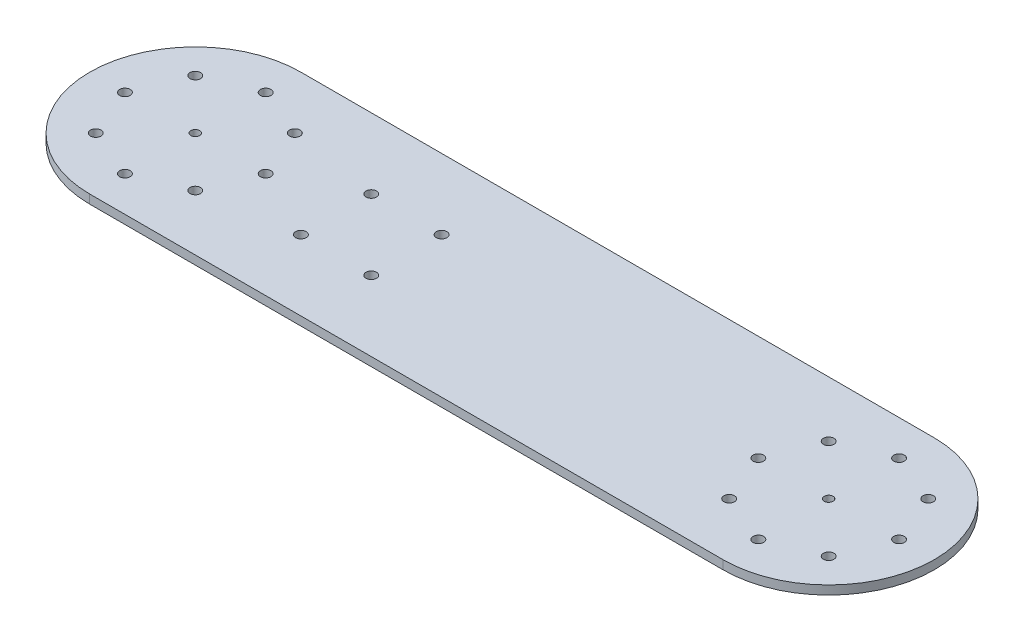
ISO-10303-21;
HEADER;
FILE_DESCRIPTION(('STEP AP214'),'2;1');
FILE_NAME('part.step','',(''),(''),'','','');
FILE_SCHEMA(('AUTOMOTIVE_DESIGN { 1 0 10303 214 1 1 1 1 }'));
ENDSEC;
DATA;
#1=APPLICATION_CONTEXT('core data for automotive mechanical design processes');
#2=APPLICATION_PROTOCOL_DEFINITION('international standard','automotive_design',2000,#1);
#3=PRODUCT_CONTEXT('',#1,'mechanical');
#4=PRODUCT('Part','Part','',(#3));
#5=PRODUCT_RELATED_PRODUCT_CATEGORY('part','',(#4));
#6=PRODUCT_DEFINITION_FORMATION('','',#4);
#7=PRODUCT_DEFINITION_CONTEXT('part definition',#1,'design');
#8=PRODUCT_DEFINITION('design','',#6,#7);
#9=PRODUCT_DEFINITION_SHAPE('','',#8);
#10=(LENGTH_UNIT() NAMED_UNIT(*) SI_UNIT(.MILLI.,.METRE.));
#11=(NAMED_UNIT(*) PLANE_ANGLE_UNIT() SI_UNIT($,.RADIAN.));
#12=(NAMED_UNIT(*) SI_UNIT($,.STERADIAN.) SOLID_ANGLE_UNIT());
#13=UNCERTAINTY_MEASURE_WITH_UNIT(LENGTH_MEASURE(1.E-05),#10,'distance_accuracy_value','');
#14=(GEOMETRIC_REPRESENTATION_CONTEXT(3) GLOBAL_UNCERTAINTY_ASSIGNED_CONTEXT((#13)) GLOBAL_UNIT_ASSIGNED_CONTEXT((#10,
#11,#12)) REPRESENTATION_CONTEXT('',''));
#15=CARTESIAN_POINT('',(0.,0.,0.));
#16=DIRECTION('',(0.,0.,1.));
#17=DIRECTION('',(1.,0.,0.));
#18=AXIS2_PLACEMENT_3D('',#15,#16,#17);
#19=CARTESIAN_POINT('',(-228.6,3.175,0.));
#20=DIRECTION('',(0.,1.,0.));
#21=DIRECTION('',(0.,0.,1.));
#22=AXIS2_PLACEMENT_3D('',#19,#20,#21);
#23=PLANE('',#22);
#24=CARTESIAN_POINT('',(-127.,3.175,-25.4));
#25=DIRECTION('',(0.,1.,0.));
#26=DIRECTION('',(0.,0.,1.));
#27=AXIS2_PLACEMENT_3D('',#24,#25,#26);
#28=CIRCLE('',#27,3.81);
#29=CARTESIAN_POINT('',(-127.,3.175,-21.59));
#30=VERTEX_POINT('',#29);
#31=EDGE_CURVE('E229',#30,#30,#28,.T.);
#32=ORIENTED_EDGE('',*,*,#31,.F.);
#33=EDGE_LOOP('',(#32));
#34=FACE_BOUND('',#33,.T.);
#35=CARTESIAN_POINT('',(-76.2,3.175,25.4));
#36=DIRECTION('',(0.,1.,0.));
#37=DIRECTION('',(0.,0.,1.));
#38=AXIS2_PLACEMENT_3D('',#35,#36,#37);
#39=CIRCLE('',#38,3.81);
#40=CARTESIAN_POINT('',(-76.2,3.175,29.21));
#41=VERTEX_POINT('',#40);
#42=EDGE_CURVE('E217',#41,#41,#39,.T.);
#43=ORIENTED_EDGE('',*,*,#42,.F.);
#44=EDGE_LOOP('',(#43));
#45=FACE_BOUND('',#44,.T.);
#46=CARTESIAN_POINT('',(228.6,3.175,-50.8000000000001));
#47=DIRECTION('',(0.,1.,0.));
#48=DIRECTION('',(0.,0.,-1.));
#49=AXIS2_PLACEMENT_3D('',#46,#47,#48);
#50=CIRCLE('',#49,3.81000000000001);
#51=CARTESIAN_POINT('',(228.6,3.175,-54.6100000000001));
#52=VERTEX_POINT('',#51);
#53=EDGE_CURVE('E205',#52,#52,#50,.T.);
#54=ORIENTED_EDGE('',*,*,#53,.F.);
#55=EDGE_LOOP('',(#54));
#56=FACE_BOUND('',#55,.T.);
#57=CARTESIAN_POINT('',(177.799999999996,3.175,-4.12361805567513E-12));
#58=DIRECTION('',(0.,1.,0.));
#59=DIRECTION('',(0.,0.,-1.));
#60=AXIS2_PLACEMENT_3D('',#57,#58,#59);
#61=CIRCLE('',#60,3.81000000000001);
#62=CARTESIAN_POINT('',(177.799999999996,3.175,-3.81000000000414));
#63=VERTEX_POINT('',#62);
#64=EDGE_CURVE('E193',#63,#63,#61,.T.);
#65=ORIENTED_EDGE('',*,*,#64,.F.);
#66=EDGE_LOOP('',(#65));
#67=FACE_BOUND('',#66,.T.);
#68=CARTESIAN_POINT('',(228.599999999992,3.175,50.8000000000003));
#69=DIRECTION('',(0.,1.,0.));
#70=DIRECTION('',(0.,0.,-1.));
#71=AXIS2_PLACEMENT_3D('',#68,#69,#70);
#72=CIRCLE('',#71,3.81000000000001);
#73=CARTESIAN_POINT('',(228.599999999992,3.175,46.9900000000003));
#74=VERTEX_POINT('',#73);
#75=EDGE_CURVE('E181',#74,#74,#72,.T.);
#76=ORIENTED_EDGE('',*,*,#75,.F.);
#77=EDGE_LOOP('',(#76));
#78=FACE_BOUND('',#77,.T.);
#79=CARTESIAN_POINT('',(279.399999999996,3.175,4.34470325974864E-12));
#80=DIRECTION('',(0.,1.,0.));
#81=DIRECTION('',(0.,0.,-1.));
#82=AXIS2_PLACEMENT_3D('',#79,#80,#81);
#83=CIRCLE('',#82,3.80999999999999);
#84=CARTESIAN_POINT('',(279.399999999996,3.175,-3.80999999999564));
#85=VERTEX_POINT('',#84);
#86=EDGE_CURVE('E169',#85,#85,#83,.T.);
#87=ORIENTED_EDGE('',*,*,#86,.F.);
#88=EDGE_LOOP('',(#87));
#89=FACE_BOUND('',#88,.T.);
#90=CARTESIAN_POINT('',(-264.521024484276,3.175,-35.9210244842735));
#91=DIRECTION('',(0.,1.,0.));
#92=DIRECTION('',(0.,0.,1.));
#93=AXIS2_PLACEMENT_3D('',#90,#91,#92);
#94=CIRCLE('',#93,3.81000000000057);
#95=CARTESIAN_POINT('',(-264.521024484276,3.175,-32.111024484273));
#96=VERTEX_POINT('',#95);
#97=EDGE_CURVE('E157',#96,#96,#94,.T.);
#98=ORIENTED_EDGE('',*,*,#97,.F.);
#99=EDGE_LOOP('',(#98));
#100=FACE_BOUND('',#99,.T.);
#101=CARTESIAN_POINT('',(-264.52102448427,3.175,35.9210244842799));
#102=DIRECTION('',(0.,1.,0.));
#103=DIRECTION('',(0.,0.,1.));
#104=AXIS2_PLACEMENT_3D('',#101,#102,#103);
#105=CIRCLE('',#104,3.80999999999998);
#106=CARTESIAN_POINT('',(-264.52102448427,3.175,39.7310244842799));
#107=VERTEX_POINT('',#106);
#108=EDGE_CURVE('E145',#107,#107,#105,.T.);
#109=ORIENTED_EDGE('',*,*,#108,.F.);
#110=EDGE_LOOP('',(#109));
#111=FACE_BOUND('',#110,.T.);
#112=CARTESIAN_POINT('',(-192.678975515716,3.175,35.9210244842739));
#113=DIRECTION('',(0.,1.,0.));
#114=DIRECTION('',(0.,0.,1.));
#115=AXIS2_PLACEMENT_3D('',#112,#113,#114);
#116=CIRCLE('',#115,3.81000000000001);
#117=CARTESIAN_POINT('',(-192.678975515716,3.175,39.7310244842739));
#118=VERTEX_POINT('',#117);
#119=EDGE_CURVE('E133',#118,#118,#116,.T.);
#120=ORIENTED_EDGE('',*,*,#119,.F.);
#121=EDGE_LOOP('',(#120));
#122=FACE_BOUND('',#121,.T.);
#123=CARTESIAN_POINT('',(-192.678975515722,3.175,-35.9210244842797));
#124=DIRECTION('',(0.,1.,0.));
#125=DIRECTION('',(0.,0.,1.));
#126=AXIS2_PLACEMENT_3D('',#123,#124,#125);
#127=CIRCLE('',#126,3.80999999999994);
#128=CARTESIAN_POINT('',(-192.678975515722,3.175,-32.1110244842797));
#129=VERTEX_POINT('',#128);
#130=EDGE_CURVE('E121',#129,#129,#127,.T.);
#131=ORIENTED_EDGE('',*,*,#130,.F.);
#132=EDGE_LOOP('',(#131));
#133=FACE_BOUND('',#132,.T.);
#134=CARTESIAN_POINT('',(-228.6,3.175,-50.8));
#135=DIRECTION('',(0.,1.,0.));
#136=DIRECTION('',(0.,0.,1.));
#137=AXIS2_PLACEMENT_3D('',#134,#135,#136);
#138=CIRCLE('',#137,3.81000000000001);
#139=CARTESIAN_POINT('',(-228.6,3.175,-46.99));
#140=VERTEX_POINT('',#139);
#141=EDGE_CURVE('E100',#140,#140,#138,.T.);
#142=ORIENTED_EDGE('',*,*,#141,.F.);
#143=EDGE_LOOP('',(#142));
#144=FACE_BOUND('',#143,.T.);
#145=CARTESIAN_POINT('',(-228.6,3.175,0.));
#146=DIRECTION('',(0.,1.,0.));
#147=DIRECTION('',(0.,0.,1.));
#148=AXIS2_PLACEMENT_3D('',#145,#146,#147);
#149=CIRCLE('',#148,76.2);
#150=CARTESIAN_POINT('',(-228.6,3.175,-76.2));
#151=VERTEX_POINT('',#150);
#152=CARTESIAN_POINT('',(-228.6,3.175,76.2));
#153=VERTEX_POINT('',#152);
#154=EDGE_CURVE('E85',#151,#153,#149,.T.);
#155=ORIENTED_EDGE('',*,*,#154,.T.);
#156=DIRECTION('',(1.,0.,0.));
#157=VECTOR('',#156,1.);
#158=CARTESIAN_POINT('',(-228.6,3.175,76.2));
#159=LINE('',#158,#157);
#160=CARTESIAN_POINT('',(228.6,3.175,76.2));
#161=VERTEX_POINT('',#160);
#162=EDGE_CURVE('E80',#153,#161,#159,.T.);
#163=ORIENTED_EDGE('',*,*,#162,.T.);
#164=CARTESIAN_POINT('',(228.6,3.175,0.));
#165=DIRECTION('',(0.,1.,0.));
#166=DIRECTION('',(0.,0.,1.));
#167=AXIS2_PLACEMENT_3D('',#164,#165,#166);
#168=CIRCLE('',#167,76.2);
#169=CARTESIAN_POINT('',(228.6,3.175,-76.2));
#170=VERTEX_POINT('',#169);
#171=EDGE_CURVE('E83',#161,#170,#168,.T.);
#172=ORIENTED_EDGE('',*,*,#171,.T.);
#173=DIRECTION('',(-1.,0.,0.));
#174=VECTOR('',#173,1.);
#175=CARTESIAN_POINT('',(-228.6,3.175,-76.2));
#176=LINE('',#175,#174);
#177=EDGE_CURVE('E50',#170,#151,#176,.T.);
#178=ORIENTED_EDGE('',*,*,#177,.T.);
#179=EDGE_LOOP('',(#155,#163,#172,#178));
#180=FACE_BOUND('',#179,.T.);
#181=CARTESIAN_POINT('',(-228.6,3.175,0.));
#182=DIRECTION('',(0.,1.,0.));
#183=DIRECTION('',(0.,0.,1.));
#184=AXIS2_PLACEMENT_3D('',#181,#182,#183);
#185=CIRCLE('',#184,3.175);
#186=CARTESIAN_POINT('',(-228.6,3.175,3.175));
#187=VERTEX_POINT('',#186);
#188=EDGE_CURVE('E115',#187,#187,#185,.T.);
#189=ORIENTED_EDGE('',*,*,#188,.F.);
#190=EDGE_LOOP('',(#189));
#191=FACE_BOUND('',#190,.T.);
#192=CARTESIAN_POINT('',(-177.799999999996,3.175,-4.08006961549745E-12));
#193=DIRECTION('',(0.,1.,0.));
#194=DIRECTION('',(0.,0.,1.));
#195=AXIS2_PLACEMENT_3D('',#192,#193,#194);
#196=CIRCLE('',#195,3.81000000000001);
#197=CARTESIAN_POINT('',(-177.799999999996,3.175,3.80999999999593));
#198=VERTEX_POINT('',#197);
#199=EDGE_CURVE('E127',#198,#198,#196,.T.);
#200=ORIENTED_EDGE('',*,*,#199,.F.);
#201=EDGE_LOOP('',(#200));
#202=FACE_BOUND('',#201,.T.);
#203=CARTESIAN_POINT('',(-228.599999999991,3.175,50.8000000000004));
#204=DIRECTION('',(0.,1.,0.));
#205=DIRECTION('',(0.,0.,1.));
#206=AXIS2_PLACEMENT_3D('',#203,#204,#205);
#207=CIRCLE('',#206,3.81000000000001);
#208=CARTESIAN_POINT('',(-228.599999999991,3.175,54.6100000000004));
#209=VERTEX_POINT('',#208);
#210=EDGE_CURVE('E139',#209,#209,#207,.T.);
#211=ORIENTED_EDGE('',*,*,#210,.F.);
#212=EDGE_LOOP('',(#211));
#213=FACE_BOUND('',#212,.T.);
#214=CARTESIAN_POINT('',(-279.399999999996,3.175,4.413136522885E-12));
#215=DIRECTION('',(0.,1.,0.));
#216=DIRECTION('',(0.,0.,1.));
#217=AXIS2_PLACEMENT_3D('',#214,#215,#216);
#218=CIRCLE('',#217,3.80999999999999);
#219=CARTESIAN_POINT('',(-279.399999999996,3.175,3.8100000000044));
#220=VERTEX_POINT('',#219);
#221=EDGE_CURVE('E151',#220,#220,#218,.T.);
#222=ORIENTED_EDGE('',*,*,#221,.F.);
#223=EDGE_LOOP('',(#222));
#224=FACE_BOUND('',#223,.T.);
#225=CARTESIAN_POINT('',(228.6,3.175,0.));
#226=DIRECTION('',(0.,1.,0.));
#227=DIRECTION('',(0.,0.,-1.));
#228=AXIS2_PLACEMENT_3D('',#225,#226,#227);
#229=CIRCLE('',#228,3.175);
#230=CARTESIAN_POINT('',(228.6,3.175,-3.17500000000005));
#231=VERTEX_POINT('',#230);
#232=EDGE_CURVE('E163',#231,#231,#229,.T.);
#233=ORIENTED_EDGE('',*,*,#232,.F.);
#234=EDGE_LOOP('',(#233));
#235=FACE_BOUND('',#234,.T.);
#236=CARTESIAN_POINT('',(264.52102448427,3.175,35.9210244842799));
#237=DIRECTION('',(0.,1.,0.));
#238=DIRECTION('',(0.,0.,-1.));
#239=AXIS2_PLACEMENT_3D('',#236,#237,#238);
#240=CIRCLE('',#239,3.80999999999998);
#241=CARTESIAN_POINT('',(264.52102448427,3.175,32.1110244842799));
#242=VERTEX_POINT('',#241);
#243=EDGE_CURVE('E175',#242,#242,#240,.T.);
#244=ORIENTED_EDGE('',*,*,#243,.F.);
#245=EDGE_LOOP('',(#244));
#246=FACE_BOUND('',#245,.T.);
#247=CARTESIAN_POINT('',(192.678975515716,3.175,35.9210244842738));
#248=DIRECTION('',(0.,1.,0.));
#249=DIRECTION('',(0.,0.,-1.));
#250=AXIS2_PLACEMENT_3D('',#247,#248,#249);
#251=CIRCLE('',#250,3.81000000000001);
#252=CARTESIAN_POINT('',(192.678975515716,3.175,32.1110244842738));
#253=VERTEX_POINT('',#252);
#254=EDGE_CURVE('E187',#253,#253,#251,.T.);
#255=ORIENTED_EDGE('',*,*,#254,.F.);
#256=EDGE_LOOP('',(#255));
#257=FACE_BOUND('',#256,.T.);
#258=CARTESIAN_POINT('',(192.678975515722,3.175,-35.9210244842796));
#259=DIRECTION('',(0.,1.,0.));
#260=DIRECTION('',(0.,0.,-1.));
#261=AXIS2_PLACEMENT_3D('',#258,#259,#260);
#262=CIRCLE('',#261,3.80999999999996);
#263=CARTESIAN_POINT('',(192.678975515722,3.175,-39.7310244842796));
#264=VERTEX_POINT('',#263);
#265=EDGE_CURVE('E199',#264,#264,#262,.T.);
#266=ORIENTED_EDGE('',*,*,#265,.F.);
#267=EDGE_LOOP('',(#266));
#268=FACE_BOUND('',#267,.T.);
#269=CARTESIAN_POINT('',(264.521024484276,3.175,-35.9210244842736));
#270=DIRECTION('',(0.,1.,0.));
#271=DIRECTION('',(0.,0.,-1.));
#272=AXIS2_PLACEMENT_3D('',#269,#270,#271);
#273=CIRCLE('',#272,3.81000000000057);
#274=CARTESIAN_POINT('',(264.521024484276,3.175,-39.7310244842742));
#275=VERTEX_POINT('',#274);
#276=EDGE_CURVE('E211',#275,#275,#273,.T.);
#277=ORIENTED_EDGE('',*,*,#276,.F.);
#278=EDGE_LOOP('',(#277));
#279=FACE_BOUND('',#278,.T.);
#280=CARTESIAN_POINT('',(-127.,3.175,25.4));
#281=DIRECTION('',(0.,1.,0.));
#282=DIRECTION('',(0.,0.,1.));
#283=AXIS2_PLACEMENT_3D('',#280,#281,#282);
#284=CIRCLE('',#283,3.81);
#285=CARTESIAN_POINT('',(-127.,3.175,29.21));
#286=VERTEX_POINT('',#285);
#287=EDGE_CURVE('E223',#286,#286,#284,.T.);
#288=ORIENTED_EDGE('',*,*,#287,.F.);
#289=EDGE_LOOP('',(#288));
#290=FACE_BOUND('',#289,.T.);
#291=CARTESIAN_POINT('',(-76.2,3.175,-25.4));
#292=DIRECTION('',(0.,1.,0.));
#293=DIRECTION('',(0.,0.,1.));
#294=AXIS2_PLACEMENT_3D('',#291,#292,#293);
#295=CIRCLE('',#294,3.81);
#296=CARTESIAN_POINT('',(-76.2,3.175,-21.59));
#297=VERTEX_POINT('',#296);
#298=EDGE_CURVE('E235',#297,#297,#295,.T.);
#299=ORIENTED_EDGE('',*,*,#298,.F.);
#300=EDGE_LOOP('',(#299));
#301=FACE_BOUND('',#300,.T.);
#302=ADVANCED_FACE('F33',(#34,#45,#56,#67,#78,#89,#100,#111,#122,#133,#144,#180,#191,#202,#213,
#224,#235,#246,#257,#268,#279,#290,#301),#23,.T.);
#303=CARTESIAN_POINT('',(-228.6,-3.175,0.));
#304=DIRECTION('',(0.,1.,0.));
#305=DIRECTION('',(0.,0.,1.));
#306=AXIS2_PLACEMENT_3D('',#303,#304,#305);
#307=PLANE('',#306);
#308=CARTESIAN_POINT('',(-228.6,-3.175,0.));
#309=DIRECTION('',(0.,1.,0.));
#310=DIRECTION('',(0.,0.,1.));
#311=AXIS2_PLACEMENT_3D('',#308,#309,#310);
#312=CIRCLE('',#311,76.2);
#313=CARTESIAN_POINT('',(-228.6,-3.175,-76.2));
#314=VERTEX_POINT('',#313);
#315=CARTESIAN_POINT('',(-228.6,-3.175,76.2));
#316=VERTEX_POINT('',#315);
#317=EDGE_CURVE('E97',#314,#316,#312,.T.);
#318=ORIENTED_EDGE('',*,*,#317,.F.);
#319=DIRECTION('',(-1.,0.,0.));
#320=VECTOR('',#319,1.);
#321=CARTESIAN_POINT('',(-228.6,-3.175,-76.2));
#322=LINE('',#321,#320);
#323=CARTESIAN_POINT('',(228.6,-3.175,-76.2));
#324=VERTEX_POINT('',#323);
#325=EDGE_CURVE('E73',#324,#314,#322,.T.);
#326=ORIENTED_EDGE('',*,*,#325,.F.);
#327=CARTESIAN_POINT('',(228.6,-3.175,0.));
#328=DIRECTION('',(0.,1.,0.));
#329=DIRECTION('',(0.,0.,1.));
#330=AXIS2_PLACEMENT_3D('',#327,#328,#329);
#331=CIRCLE('',#330,76.2);
#332=CARTESIAN_POINT('',(228.6,-3.175,76.2));
#333=VERTEX_POINT('',#332);
#334=EDGE_CURVE('E67',#333,#324,#331,.T.);
#335=ORIENTED_EDGE('',*,*,#334,.F.);
#336=DIRECTION('',(1.,0.,0.));
#337=VECTOR('',#336,1.);
#338=CARTESIAN_POINT('',(-228.6,-3.175,76.2));
#339=LINE('',#338,#337);
#340=EDGE_CURVE('E89',#316,#333,#339,.T.);
#341=ORIENTED_EDGE('',*,*,#340,.F.);
#342=EDGE_LOOP('',(#318,#326,#335,#341));
#343=FACE_BOUND('',#342,.T.);
#344=CARTESIAN_POINT('',(-228.6,-3.175,-50.8));
#345=DIRECTION('',(0.,1.,0.));
#346=DIRECTION('',(0.,0.,1.));
#347=AXIS2_PLACEMENT_3D('',#344,#345,#346);
#348=CIRCLE('',#347,3.81000000000001);
#349=CARTESIAN_POINT('',(-228.6,-3.175,-46.99));
#350=VERTEX_POINT('',#349);
#351=EDGE_CURVE('E112',#350,#350,#348,.T.);
#352=ORIENTED_EDGE('',*,*,#351,.T.);
#353=EDGE_LOOP('',(#352));
#354=FACE_BOUND('',#353,.T.);
#355=CARTESIAN_POINT('',(-228.6,-3.175,0.));
#356=DIRECTION('',(0.,1.,0.));
#357=DIRECTION('',(0.,0.,1.));
#358=AXIS2_PLACEMENT_3D('',#355,#356,#357);
#359=CIRCLE('',#358,3.175);
#360=CARTESIAN_POINT('',(-228.6,-3.175,3.175));
#361=VERTEX_POINT('',#360);
#362=EDGE_CURVE('E118',#361,#361,#359,.T.);
#363=ORIENTED_EDGE('',*,*,#362,.T.);
#364=EDGE_LOOP('',(#363));
#365=FACE_BOUND('',#364,.T.);
#366=CARTESIAN_POINT('',(-192.678975515722,-3.175,-35.9210244842797));
#367=DIRECTION('',(0.,1.,0.));
#368=DIRECTION('',(0.,0.,1.));
#369=AXIS2_PLACEMENT_3D('',#366,#367,#368);
#370=CIRCLE('',#369,3.80999999999994);
#371=CARTESIAN_POINT('',(-192.678975515722,-3.175,-32.1110244842797));
#372=VERTEX_POINT('',#371);
#373=EDGE_CURVE('E124',#372,#372,#370,.T.);
#374=ORIENTED_EDGE('',*,*,#373,.T.);
#375=EDGE_LOOP('',(#374));
#376=FACE_BOUND('',#375,.T.);
#377=CARTESIAN_POINT('',(-177.799999999996,-3.175,-4.08006961549745E-12));
#378=DIRECTION('',(0.,1.,0.));
#379=DIRECTION('',(0.,0.,1.));
#380=AXIS2_PLACEMENT_3D('',#377,#378,#379);
#381=CIRCLE('',#380,3.81000000000001);
#382=CARTESIAN_POINT('',(-177.799999999996,-3.175,3.80999999999593));
#383=VERTEX_POINT('',#382);
#384=EDGE_CURVE('E130',#383,#383,#381,.T.);
#385=ORIENTED_EDGE('',*,*,#384,.T.);
#386=EDGE_LOOP('',(#385));
#387=FACE_BOUND('',#386,.T.);
#388=CARTESIAN_POINT('',(-192.678975515716,-3.175,35.9210244842739));
#389=DIRECTION('',(0.,1.,0.));
#390=DIRECTION('',(0.,0.,1.));
#391=AXIS2_PLACEMENT_3D('',#388,#389,#390);
#392=CIRCLE('',#391,3.81000000000001);
#393=CARTESIAN_POINT('',(-192.678975515716,-3.175,39.7310244842739));
#394=VERTEX_POINT('',#393);
#395=EDGE_CURVE('E136',#394,#394,#392,.T.);
#396=ORIENTED_EDGE('',*,*,#395,.T.);
#397=EDGE_LOOP('',(#396));
#398=FACE_BOUND('',#397,.T.);
#399=CARTESIAN_POINT('',(-228.599999999991,-3.175,50.8000000000004));
#400=DIRECTION('',(0.,1.,0.));
#401=DIRECTION('',(0.,0.,1.));
#402=AXIS2_PLACEMENT_3D('',#399,#400,#401);
#403=CIRCLE('',#402,3.81000000000001);
#404=CARTESIAN_POINT('',(-228.599999999991,-3.175,54.6100000000004));
#405=VERTEX_POINT('',#404);
#406=EDGE_CURVE('E142',#405,#405,#403,.T.);
#407=ORIENTED_EDGE('',*,*,#406,.T.);
#408=EDGE_LOOP('',(#407));
#409=FACE_BOUND('',#408,.T.);
#410=CARTESIAN_POINT('',(-264.52102448427,-3.175,35.9210244842799));
#411=DIRECTION('',(0.,1.,0.));
#412=DIRECTION('',(0.,0.,1.));
#413=AXIS2_PLACEMENT_3D('',#410,#411,#412);
#414=CIRCLE('',#413,3.80999999999998);
#415=CARTESIAN_POINT('',(-264.52102448427,-3.175,39.7310244842799));
#416=VERTEX_POINT('',#415);
#417=EDGE_CURVE('E148',#416,#416,#414,.T.);
#418=ORIENTED_EDGE('',*,*,#417,.T.);
#419=EDGE_LOOP('',(#418));
#420=FACE_BOUND('',#419,.T.);
#421=CARTESIAN_POINT('',(-279.399999999996,-3.175,4.413136522885E-12));
#422=DIRECTION('',(0.,1.,0.));
#423=DIRECTION('',(0.,0.,1.));
#424=AXIS2_PLACEMENT_3D('',#421,#422,#423);
#425=CIRCLE('',#424,3.80999999999999);
#426=CARTESIAN_POINT('',(-279.399999999996,-3.175,3.8100000000044));
#427=VERTEX_POINT('',#426);
#428=EDGE_CURVE('E154',#427,#427,#425,.T.);
#429=ORIENTED_EDGE('',*,*,#428,.T.);
#430=EDGE_LOOP('',(#429));
#431=FACE_BOUND('',#430,.T.);
#432=CARTESIAN_POINT('',(-264.521024484276,-3.175,-35.9210244842735));
#433=DIRECTION('',(0.,1.,0.));
#434=DIRECTION('',(0.,0.,1.));
#435=AXIS2_PLACEMENT_3D('',#432,#433,#434);
#436=CIRCLE('',#435,3.81000000000057);
#437=CARTESIAN_POINT('',(-264.521024484276,-3.175,-32.111024484273));
#438=VERTEX_POINT('',#437);
#439=EDGE_CURVE('E160',#438,#438,#436,.T.);
#440=ORIENTED_EDGE('',*,*,#439,.T.);
#441=EDGE_LOOP('',(#440));
#442=FACE_BOUND('',#441,.T.);
#443=CARTESIAN_POINT('',(228.6,-3.175,0.));
#444=DIRECTION('',(0.,1.,0.));
#445=DIRECTION('',(0.,0.,-1.));
#446=AXIS2_PLACEMENT_3D('',#443,#444,#445);
#447=CIRCLE('',#446,3.175);
#448=CARTESIAN_POINT('',(228.6,-3.175,-3.17500000000005));
#449=VERTEX_POINT('',#448);
#450=EDGE_CURVE('E166',#449,#449,#447,.T.);
#451=ORIENTED_EDGE('',*,*,#450,.T.);
#452=EDGE_LOOP('',(#451));
#453=FACE_BOUND('',#452,.T.);
#454=CARTESIAN_POINT('',(279.399999999996,-3.175,4.34470325974864E-12));
#455=DIRECTION('',(0.,1.,0.));
#456=DIRECTION('',(0.,0.,-1.));
#457=AXIS2_PLACEMENT_3D('',#454,#455,#456);
#458=CIRCLE('',#457,3.80999999999999);
#459=CARTESIAN_POINT('',(279.399999999996,-3.175,-3.80999999999564));
#460=VERTEX_POINT('',#459);
#461=EDGE_CURVE('E172',#460,#460,#458,.T.);
#462=ORIENTED_EDGE('',*,*,#461,.T.);
#463=EDGE_LOOP('',(#462));
#464=FACE_BOUND('',#463,.T.);
#465=CARTESIAN_POINT('',(264.52102448427,-3.175,35.9210244842799));
#466=DIRECTION('',(0.,1.,0.));
#467=DIRECTION('',(0.,0.,-1.));
#468=AXIS2_PLACEMENT_3D('',#465,#466,#467);
#469=CIRCLE('',#468,3.80999999999998);
#470=CARTESIAN_POINT('',(264.52102448427,-3.175,32.1110244842799));
#471=VERTEX_POINT('',#470);
#472=EDGE_CURVE('E178',#471,#471,#469,.T.);
#473=ORIENTED_EDGE('',*,*,#472,.T.);
#474=EDGE_LOOP('',(#473));
#475=FACE_BOUND('',#474,.T.);
#476=CARTESIAN_POINT('',(228.599999999992,-3.175,50.8000000000003));
#477=DIRECTION('',(0.,1.,0.));
#478=DIRECTION('',(0.,0.,-1.));
#479=AXIS2_PLACEMENT_3D('',#476,#477,#478);
#480=CIRCLE('',#479,3.81000000000001);
#481=CARTESIAN_POINT('',(228.599999999992,-3.175,46.9900000000003));
#482=VERTEX_POINT('',#481);
#483=EDGE_CURVE('E184',#482,#482,#480,.T.);
#484=ORIENTED_EDGE('',*,*,#483,.T.);
#485=EDGE_LOOP('',(#484));
#486=FACE_BOUND('',#485,.T.);
#487=CARTESIAN_POINT('',(192.678975515716,-3.175,35.9210244842738));
#488=DIRECTION('',(0.,1.,0.));
#489=DIRECTION('',(0.,0.,-1.));
#490=AXIS2_PLACEMENT_3D('',#487,#488,#489);
#491=CIRCLE('',#490,3.81000000000001);
#492=CARTESIAN_POINT('',(192.678975515716,-3.175,32.1110244842738));
#493=VERTEX_POINT('',#492);
#494=EDGE_CURVE('E190',#493,#493,#491,.T.);
#495=ORIENTED_EDGE('',*,*,#494,.T.);
#496=EDGE_LOOP('',(#495));
#497=FACE_BOUND('',#496,.T.);
#498=CARTESIAN_POINT('',(177.799999999996,-3.175,-4.12361805567513E-12));
#499=DIRECTION('',(0.,1.,0.));
#500=DIRECTION('',(0.,0.,-1.));
#501=AXIS2_PLACEMENT_3D('',#498,#499,#500);
#502=CIRCLE('',#501,3.81000000000001);
#503=CARTESIAN_POINT('',(177.799999999996,-3.175,-3.81000000000414));
#504=VERTEX_POINT('',#503);
#505=EDGE_CURVE('E196',#504,#504,#502,.T.);
#506=ORIENTED_EDGE('',*,*,#505,.T.);
#507=EDGE_LOOP('',(#506));
#508=FACE_BOUND('',#507,.T.);
#509=CARTESIAN_POINT('',(192.678975515722,-3.175,-35.9210244842796));
#510=DIRECTION('',(0.,1.,0.));
#511=DIRECTION('',(0.,0.,-1.));
#512=AXIS2_PLACEMENT_3D('',#509,#510,#511);
#513=CIRCLE('',#512,3.80999999999996);
#514=CARTESIAN_POINT('',(192.678975515722,-3.175,-39.7310244842796));
#515=VERTEX_POINT('',#514);
#516=EDGE_CURVE('E202',#515,#515,#513,.T.);
#517=ORIENTED_EDGE('',*,*,#516,.T.);
#518=EDGE_LOOP('',(#517));
#519=FACE_BOUND('',#518,.T.);
#520=CARTESIAN_POINT('',(228.6,-3.175,-50.8000000000001));
#521=DIRECTION('',(0.,1.,0.));
#522=DIRECTION('',(0.,0.,-1.));
#523=AXIS2_PLACEMENT_3D('',#520,#521,#522);
#524=CIRCLE('',#523,3.81000000000001);
#525=CARTESIAN_POINT('',(228.6,-3.175,-54.6100000000001));
#526=VERTEX_POINT('',#525);
#527=EDGE_CURVE('E208',#526,#526,#524,.T.);
#528=ORIENTED_EDGE('',*,*,#527,.T.);
#529=EDGE_LOOP('',(#528));
#530=FACE_BOUND('',#529,.T.);
#531=CARTESIAN_POINT('',(264.521024484276,-3.175,-35.9210244842736));
#532=DIRECTION('',(0.,1.,0.));
#533=DIRECTION('',(0.,0.,-1.));
#534=AXIS2_PLACEMENT_3D('',#531,#532,#533);
#535=CIRCLE('',#534,3.81000000000057);
#536=CARTESIAN_POINT('',(264.521024484276,-3.175,-39.7310244842742));
#537=VERTEX_POINT('',#536);
#538=EDGE_CURVE('E214',#537,#537,#535,.T.);
#539=ORIENTED_EDGE('',*,*,#538,.T.);
#540=EDGE_LOOP('',(#539));
#541=FACE_BOUND('',#540,.T.);
#542=CARTESIAN_POINT('',(-76.2,-3.175,25.4));
#543=DIRECTION('',(0.,1.,0.));
#544=DIRECTION('',(0.,0.,1.));
#545=AXIS2_PLACEMENT_3D('',#542,#543,#544);
#546=CIRCLE('',#545,3.81);
#547=CARTESIAN_POINT('',(-76.2,-3.175,29.21));
#548=VERTEX_POINT('',#547);
#549=EDGE_CURVE('E220',#548,#548,#546,.T.);
#550=ORIENTED_EDGE('',*,*,#549,.T.);
#551=EDGE_LOOP('',(#550));
#552=FACE_BOUND('',#551,.T.);
#553=CARTESIAN_POINT('',(-127.,-3.175,25.4));
#554=DIRECTION('',(0.,1.,0.));
#555=DIRECTION('',(0.,0.,1.));
#556=AXIS2_PLACEMENT_3D('',#553,#554,#555);
#557=CIRCLE('',#556,3.81);
#558=CARTESIAN_POINT('',(-127.,-3.175,29.21));
#559=VERTEX_POINT('',#558);
#560=EDGE_CURVE('E226',#559,#559,#557,.T.);
#561=ORIENTED_EDGE('',*,*,#560,.T.);
#562=EDGE_LOOP('',(#561));
#563=FACE_BOUND('',#562,.T.);
#564=CARTESIAN_POINT('',(-127.,-3.175,-25.4));
#565=DIRECTION('',(0.,1.,0.));
#566=DIRECTION('',(0.,0.,1.));
#567=AXIS2_PLACEMENT_3D('',#564,#565,#566);
#568=CIRCLE('',#567,3.81);
#569=CARTESIAN_POINT('',(-127.,-3.175,-21.59));
#570=VERTEX_POINT('',#569);
#571=EDGE_CURVE('E232',#570,#570,#568,.T.);
#572=ORIENTED_EDGE('',*,*,#571,.T.);
#573=EDGE_LOOP('',(#572));
#574=FACE_BOUND('',#573,.T.);
#575=CARTESIAN_POINT('',(-76.2,-3.175,-25.4));
#576=DIRECTION('',(0.,1.,0.));
#577=DIRECTION('',(0.,0.,1.));
#578=AXIS2_PLACEMENT_3D('',#575,#576,#577);
#579=CIRCLE('',#578,3.81);
#580=CARTESIAN_POINT('',(-76.2,-3.175,-21.59));
#581=VERTEX_POINT('',#580);
#582=EDGE_CURVE('E238',#581,#581,#579,.T.);
#583=ORIENTED_EDGE('',*,*,#582,.T.);
#584=EDGE_LOOP('',(#583));
#585=FACE_BOUND('',#584,.T.);
#586=ADVANCED_FACE('F108',(#343,#354,#365,#376,#387,#398,#409,#420,#431,#442,#453,#464,#475,
#486,#497,#508,#519,#530,#541,#552,#563,#574,#585),#307,.F.);
#587=CARTESIAN_POINT('',(-228.6,3.175,0.));
#588=DIRECTION('',(0.,-1.,0.));
#589=DIRECTION('',(0.,0.,-1.));
#590=AXIS2_PLACEMENT_3D('',#587,#588,#589);
#591=CYLINDRICAL_SURFACE('',#590,76.2);
#592=ORIENTED_EDGE('',*,*,#317,.T.);
#593=DIRECTION('',(0.,-1.,0.));
#594=VECTOR('',#593,1.);
#595=CARTESIAN_POINT('',(-228.6,3.175,76.2));
#596=LINE('',#595,#594);
#597=EDGE_CURVE('E11',#153,#316,#596,.T.);
#598=ORIENTED_EDGE('',*,*,#597,.F.);
#599=ORIENTED_EDGE('',*,*,#154,.F.);
#600=DIRECTION('',(0.,-1.,0.));
#601=VECTOR('',#600,1.);
#602=CARTESIAN_POINT('',(-228.6,3.175,-76.2));
#603=LINE('',#602,#601);
#604=EDGE_CURVE('E93',#151,#314,#603,.T.);
#605=ORIENTED_EDGE('',*,*,#604,.T.);
#606=EDGE_LOOP('',(#592,#598,#599,#605));
#607=FACE_BOUND('',#606,.T.);
#608=ADVANCED_FACE('F35',(#607),#591,.T.);
#609=CARTESIAN_POINT('',(-228.6,3.175,76.2));
#610=DIRECTION('',(0.,0.,-1.));
#611=DIRECTION('',(-1.,0.,0.));
#612=AXIS2_PLACEMENT_3D('',#609,#610,#611);
#613=PLANE('',#612);
#614=ORIENTED_EDGE('',*,*,#340,.T.);
#615=DIRECTION('',(0.,-1.,0.));
#616=VECTOR('',#615,1.);
#617=CARTESIAN_POINT('',(228.6,3.175,76.2));
#618=LINE('',#617,#616);
#619=EDGE_CURVE('E42',#161,#333,#618,.T.);
#620=ORIENTED_EDGE('',*,*,#619,.F.);
#621=ORIENTED_EDGE('',*,*,#162,.F.);
#622=ORIENTED_EDGE('',*,*,#597,.T.);
#623=EDGE_LOOP('',(#614,#620,#621,#622));
#624=FACE_BOUND('',#623,.T.);
#625=ADVANCED_FACE('F88',(#624),#613,.F.);
#626=CARTESIAN_POINT('',(228.6,3.175,0.));
#627=DIRECTION('',(0.,-1.,0.));
#628=DIRECTION('',(0.,0.,-1.));
#629=AXIS2_PLACEMENT_3D('',#626,#627,#628);
#630=CYLINDRICAL_SURFACE('',#629,76.2);
#631=ORIENTED_EDGE('',*,*,#334,.T.);
#632=DIRECTION('',(0.,-1.,0.));
#633=VECTOR('',#632,1.);
#634=CARTESIAN_POINT('',(228.6,3.175,-76.2));
#635=LINE('',#634,#633);
#636=EDGE_CURVE('E90',#170,#324,#635,.T.);
#637=ORIENTED_EDGE('',*,*,#636,.F.);
#638=ORIENTED_EDGE('',*,*,#171,.F.);
#639=ORIENTED_EDGE('',*,*,#619,.T.);
#640=EDGE_LOOP('',(#631,#637,#638,#639));
#641=FACE_BOUND('',#640,.T.);
#642=ADVANCED_FACE('F91',(#641),#630,.T.);
#643=CARTESIAN_POINT('',(-228.6,3.175,-76.2));
#644=DIRECTION('',(0.,0.,1.));
#645=DIRECTION('',(1.,0.,0.));
#646=AXIS2_PLACEMENT_3D('',#643,#644,#645);
#647=PLANE('',#646);
#648=ORIENTED_EDGE('',*,*,#325,.T.);
#649=ORIENTED_EDGE('',*,*,#604,.F.);
#650=ORIENTED_EDGE('',*,*,#177,.F.);
#651=ORIENTED_EDGE('',*,*,#636,.T.);
#652=EDGE_LOOP('',(#648,#649,#650,#651));
#653=FACE_BOUND('',#652,.T.);
#654=ADVANCED_FACE('F105',(#653),#647,.F.);
#655=CARTESIAN_POINT('',(-228.6,3.175,-50.8));
#656=DIRECTION('',(0.,-1.,0.));
#657=DIRECTION('',(0.,0.,-1.));
#658=AXIS2_PLACEMENT_3D('',#655,#656,#657);
#659=CYLINDRICAL_SURFACE('',#658,3.81000000000001);
#660=ORIENTED_EDGE('',*,*,#141,.T.);
#661=EDGE_LOOP('',(#660));
#662=FACE_BOUND('',#661,.T.);
#663=ORIENTED_EDGE('',*,*,#351,.F.);
#664=EDGE_LOOP('',(#663));
#665=FACE_BOUND('',#664,.T.);
#666=ADVANCED_FACE('F257',(#662,#665),#659,.F.);
#667=CARTESIAN_POINT('',(-228.6,3.175,0.));
#668=DIRECTION('',(0.,-1.,0.));
#669=DIRECTION('',(0.,0.,-1.));
#670=AXIS2_PLACEMENT_3D('',#667,#668,#669);
#671=CYLINDRICAL_SURFACE('',#670,3.175);
#672=ORIENTED_EDGE('',*,*,#188,.T.);
#673=EDGE_LOOP('',(#672));
#674=FACE_BOUND('',#673,.T.);
#675=ORIENTED_EDGE('',*,*,#362,.F.);
#676=EDGE_LOOP('',(#675));
#677=FACE_BOUND('',#676,.T.);
#678=ADVANCED_FACE('F303',(#674,#677),#671,.F.);
#679=CARTESIAN_POINT('',(-192.678975515722,3.175,-35.9210244842797));
#680=DIRECTION('',(0.,-1.,0.));
#681=DIRECTION('',(0.,0.,-1.));
#682=AXIS2_PLACEMENT_3D('',#679,#680,#681);
#683=CYLINDRICAL_SURFACE('',#682,3.80999999999994);
#684=ORIENTED_EDGE('',*,*,#130,.T.);
#685=EDGE_LOOP('',(#684));
#686=FACE_BOUND('',#685,.T.);
#687=ORIENTED_EDGE('',*,*,#373,.F.);
#688=EDGE_LOOP('',(#687));
#689=FACE_BOUND('',#688,.T.);
#690=ADVANCED_FACE('F311',(#686,#689),#683,.F.);
#691=CARTESIAN_POINT('',(-177.799999999996,3.175,-4.08006961549745E-12));
#692=DIRECTION('',(0.,-1.,0.));
#693=DIRECTION('',(0.,0.,-1.));
#694=AXIS2_PLACEMENT_3D('',#691,#692,#693);
#695=CYLINDRICAL_SURFACE('',#694,3.81000000000001);
#696=ORIENTED_EDGE('',*,*,#199,.T.);
#697=EDGE_LOOP('',(#696));
#698=FACE_BOUND('',#697,.T.);
#699=ORIENTED_EDGE('',*,*,#384,.F.);
#700=EDGE_LOOP('',(#699));
#701=FACE_BOUND('',#700,.T.);
#702=ADVANCED_FACE('F319',(#698,#701),#695,.F.);
#703=CARTESIAN_POINT('',(-192.678975515716,3.175,35.9210244842739));
#704=DIRECTION('',(0.,-1.,0.));
#705=DIRECTION('',(0.,0.,-1.));
#706=AXIS2_PLACEMENT_3D('',#703,#704,#705);
#707=CYLINDRICAL_SURFACE('',#706,3.81000000000001);
#708=ORIENTED_EDGE('',*,*,#119,.T.);
#709=EDGE_LOOP('',(#708));
#710=FACE_BOUND('',#709,.T.);
#711=ORIENTED_EDGE('',*,*,#395,.F.);
#712=EDGE_LOOP('',(#711));
#713=FACE_BOUND('',#712,.T.);
#714=ADVANCED_FACE('F328',(#710,#713),#707,.F.);
#715=CARTESIAN_POINT('',(-228.599999999991,3.175,50.8000000000004));
#716=DIRECTION('',(0.,-1.,0.));
#717=DIRECTION('',(0.,0.,-1.));
#718=AXIS2_PLACEMENT_3D('',#715,#716,#717);
#719=CYLINDRICAL_SURFACE('',#718,3.81000000000001);
#720=ORIENTED_EDGE('',*,*,#210,.T.);
#721=EDGE_LOOP('',(#720));
#722=FACE_BOUND('',#721,.T.);
#723=ORIENTED_EDGE('',*,*,#406,.F.);
#724=EDGE_LOOP('',(#723));
#725=FACE_BOUND('',#724,.T.);
#726=ADVANCED_FACE('F337',(#722,#725),#719,.F.);
#727=CARTESIAN_POINT('',(-264.52102448427,3.175,35.9210244842799));
#728=DIRECTION('',(0.,-1.,0.));
#729=DIRECTION('',(0.,0.,-1.));
#730=AXIS2_PLACEMENT_3D('',#727,#728,#729);
#731=CYLINDRICAL_SURFACE('',#730,3.80999999999998);
#732=ORIENTED_EDGE('',*,*,#108,.T.);
#733=EDGE_LOOP('',(#732));
#734=FACE_BOUND('',#733,.T.);
#735=ORIENTED_EDGE('',*,*,#417,.F.);
#736=EDGE_LOOP('',(#735));
#737=FACE_BOUND('',#736,.T.);
#738=ADVANCED_FACE('F346',(#734,#737),#731,.F.);
#739=CARTESIAN_POINT('',(-279.399999999996,3.175,4.413136522885E-12));
#740=DIRECTION('',(0.,-1.,0.));
#741=DIRECTION('',(0.,0.,-1.));
#742=AXIS2_PLACEMENT_3D('',#739,#740,#741);
#743=CYLINDRICAL_SURFACE('',#742,3.80999999999999);
#744=ORIENTED_EDGE('',*,*,#221,.T.);
#745=EDGE_LOOP('',(#744));
#746=FACE_BOUND('',#745,.T.);
#747=ORIENTED_EDGE('',*,*,#428,.F.);
#748=EDGE_LOOP('',(#747));
#749=FACE_BOUND('',#748,.T.);
#750=ADVANCED_FACE('F355',(#746,#749),#743,.F.);
#751=CARTESIAN_POINT('',(-264.521024484276,3.175,-35.9210244842735));
#752=DIRECTION('',(0.,-1.,0.));
#753=DIRECTION('',(0.,0.,-1.));
#754=AXIS2_PLACEMENT_3D('',#751,#752,#753);
#755=CYLINDRICAL_SURFACE('',#754,3.81000000000057);
#756=ORIENTED_EDGE('',*,*,#97,.T.);
#757=EDGE_LOOP('',(#756));
#758=FACE_BOUND('',#757,.T.);
#759=ORIENTED_EDGE('',*,*,#439,.F.);
#760=EDGE_LOOP('',(#759));
#761=FACE_BOUND('',#760,.T.);
#762=ADVANCED_FACE('F364',(#758,#761),#755,.F.);
#763=CARTESIAN_POINT('',(228.6,3.175,0.));
#764=DIRECTION('',(0.,-1.,0.));
#765=DIRECTION('',(0.,0.,-1.));
#766=AXIS2_PLACEMENT_3D('',#763,#764,#765);
#767=CYLINDRICAL_SURFACE('',#766,3.175);
#768=ORIENTED_EDGE('',*,*,#232,.T.);
#769=EDGE_LOOP('',(#768));
#770=FACE_BOUND('',#769,.T.);
#771=ORIENTED_EDGE('',*,*,#450,.F.);
#772=EDGE_LOOP('',(#771));
#773=FACE_BOUND('',#772,.T.);
#774=ADVANCED_FACE('F373',(#770,#773),#767,.F.);
#775=CARTESIAN_POINT('',(279.399999999996,3.175,4.34470325974864E-12));
#776=DIRECTION('',(0.,-1.,0.));
#777=DIRECTION('',(0.,0.,-1.));
#778=AXIS2_PLACEMENT_3D('',#775,#776,#777);
#779=CYLINDRICAL_SURFACE('',#778,3.80999999999999);
#780=ORIENTED_EDGE('',*,*,#86,.T.);
#781=EDGE_LOOP('',(#780));
#782=FACE_BOUND('',#781,.T.);
#783=ORIENTED_EDGE('',*,*,#461,.F.);
#784=EDGE_LOOP('',(#783));
#785=FACE_BOUND('',#784,.T.);
#786=ADVANCED_FACE('F382',(#782,#785),#779,.F.);
#787=CARTESIAN_POINT('',(264.52102448427,3.175,35.9210244842799));
#788=DIRECTION('',(0.,-1.,0.));
#789=DIRECTION('',(0.,0.,-1.));
#790=AXIS2_PLACEMENT_3D('',#787,#788,#789);
#791=CYLINDRICAL_SURFACE('',#790,3.80999999999998);
#792=ORIENTED_EDGE('',*,*,#243,.T.);
#793=EDGE_LOOP('',(#792));
#794=FACE_BOUND('',#793,.T.);
#795=ORIENTED_EDGE('',*,*,#472,.F.);
#796=EDGE_LOOP('',(#795));
#797=FACE_BOUND('',#796,.T.);
#798=ADVANCED_FACE('F391',(#794,#797),#791,.F.);
#799=CARTESIAN_POINT('',(228.599999999992,3.175,50.8000000000003));
#800=DIRECTION('',(0.,-1.,0.));
#801=DIRECTION('',(0.,0.,-1.));
#802=AXIS2_PLACEMENT_3D('',#799,#800,#801);
#803=CYLINDRICAL_SURFACE('',#802,3.81000000000001);
#804=ORIENTED_EDGE('',*,*,#75,.T.);
#805=EDGE_LOOP('',(#804));
#806=FACE_BOUND('',#805,.T.);
#807=ORIENTED_EDGE('',*,*,#483,.F.);
#808=EDGE_LOOP('',(#807));
#809=FACE_BOUND('',#808,.T.);
#810=ADVANCED_FACE('F400',(#806,#809),#803,.F.);
#811=CARTESIAN_POINT('',(192.678975515716,3.175,35.9210244842738));
#812=DIRECTION('',(0.,-1.,0.));
#813=DIRECTION('',(0.,0.,-1.));
#814=AXIS2_PLACEMENT_3D('',#811,#812,#813);
#815=CYLINDRICAL_SURFACE('',#814,3.81000000000001);
#816=ORIENTED_EDGE('',*,*,#254,.T.);
#817=EDGE_LOOP('',(#816));
#818=FACE_BOUND('',#817,.T.);
#819=ORIENTED_EDGE('',*,*,#494,.F.);
#820=EDGE_LOOP('',(#819));
#821=FACE_BOUND('',#820,.T.);
#822=ADVANCED_FACE('F409',(#818,#821),#815,.F.);
#823=CARTESIAN_POINT('',(177.799999999996,3.175,-4.12361805567513E-12));
#824=DIRECTION('',(0.,-1.,0.));
#825=DIRECTION('',(0.,0.,-1.));
#826=AXIS2_PLACEMENT_3D('',#823,#824,#825);
#827=CYLINDRICAL_SURFACE('',#826,3.81000000000001);
#828=ORIENTED_EDGE('',*,*,#64,.T.);
#829=EDGE_LOOP('',(#828));
#830=FACE_BOUND('',#829,.T.);
#831=ORIENTED_EDGE('',*,*,#505,.F.);
#832=EDGE_LOOP('',(#831));
#833=FACE_BOUND('',#832,.T.);
#834=ADVANCED_FACE('F418',(#830,#833),#827,.F.);
#835=CARTESIAN_POINT('',(192.678975515722,3.175,-35.9210244842796));
#836=DIRECTION('',(0.,-1.,0.));
#837=DIRECTION('',(0.,0.,-1.));
#838=AXIS2_PLACEMENT_3D('',#835,#836,#837);
#839=CYLINDRICAL_SURFACE('',#838,3.80999999999996);
#840=ORIENTED_EDGE('',*,*,#265,.T.);
#841=EDGE_LOOP('',(#840));
#842=FACE_BOUND('',#841,.T.);
#843=ORIENTED_EDGE('',*,*,#516,.F.);
#844=EDGE_LOOP('',(#843));
#845=FACE_BOUND('',#844,.T.);
#846=ADVANCED_FACE('F427',(#842,#845),#839,.F.);
#847=CARTESIAN_POINT('',(228.6,3.175,-50.8000000000001));
#848=DIRECTION('',(0.,-1.,0.));
#849=DIRECTION('',(0.,0.,-1.));
#850=AXIS2_PLACEMENT_3D('',#847,#848,#849);
#851=CYLINDRICAL_SURFACE('',#850,3.81000000000001);
#852=ORIENTED_EDGE('',*,*,#53,.T.);
#853=EDGE_LOOP('',(#852));
#854=FACE_BOUND('',#853,.T.);
#855=ORIENTED_EDGE('',*,*,#527,.F.);
#856=EDGE_LOOP('',(#855));
#857=FACE_BOUND('',#856,.T.);
#858=ADVANCED_FACE('F436',(#854,#857),#851,.F.);
#859=CARTESIAN_POINT('',(264.521024484276,3.175,-35.9210244842736));
#860=DIRECTION('',(0.,-1.,0.));
#861=DIRECTION('',(0.,0.,-1.));
#862=AXIS2_PLACEMENT_3D('',#859,#860,#861);
#863=CYLINDRICAL_SURFACE('',#862,3.81000000000057);
#864=ORIENTED_EDGE('',*,*,#276,.T.);
#865=EDGE_LOOP('',(#864));
#866=FACE_BOUND('',#865,.T.);
#867=ORIENTED_EDGE('',*,*,#538,.F.);
#868=EDGE_LOOP('',(#867));
#869=FACE_BOUND('',#868,.T.);
#870=ADVANCED_FACE('F445',(#866,#869),#863,.F.);
#871=CARTESIAN_POINT('',(-76.2,3.175,25.4));
#872=DIRECTION('',(0.,-1.,0.));
#873=DIRECTION('',(0.,0.,-1.));
#874=AXIS2_PLACEMENT_3D('',#871,#872,#873);
#875=CYLINDRICAL_SURFACE('',#874,3.81);
#876=ORIENTED_EDGE('',*,*,#42,.T.);
#877=EDGE_LOOP('',(#876));
#878=FACE_BOUND('',#877,.T.);
#879=ORIENTED_EDGE('',*,*,#549,.F.);
#880=EDGE_LOOP('',(#879));
#881=FACE_BOUND('',#880,.T.);
#882=ADVANCED_FACE('F454',(#878,#881),#875,.F.);
#883=CARTESIAN_POINT('',(-127.,3.175,25.4));
#884=DIRECTION('',(0.,-1.,0.));
#885=DIRECTION('',(0.,0.,-1.));
#886=AXIS2_PLACEMENT_3D('',#883,#884,#885);
#887=CYLINDRICAL_SURFACE('',#886,3.81);
#888=ORIENTED_EDGE('',*,*,#287,.T.);
#889=EDGE_LOOP('',(#888));
#890=FACE_BOUND('',#889,.T.);
#891=ORIENTED_EDGE('',*,*,#560,.F.);
#892=EDGE_LOOP('',(#891));
#893=FACE_BOUND('',#892,.T.);
#894=ADVANCED_FACE('F463',(#890,#893),#887,.F.);
#895=CARTESIAN_POINT('',(-127.,3.175,-25.4));
#896=DIRECTION('',(0.,-1.,0.));
#897=DIRECTION('',(0.,0.,-1.));
#898=AXIS2_PLACEMENT_3D('',#895,#896,#897);
#899=CYLINDRICAL_SURFACE('',#898,3.81);
#900=ORIENTED_EDGE('',*,*,#31,.T.);
#901=EDGE_LOOP('',(#900));
#902=FACE_BOUND('',#901,.T.);
#903=ORIENTED_EDGE('',*,*,#571,.F.);
#904=EDGE_LOOP('',(#903));
#905=FACE_BOUND('',#904,.T.);
#906=ADVANCED_FACE('F472',(#902,#905),#899,.F.);
#907=CARTESIAN_POINT('',(-76.2,3.175,-25.4));
#908=DIRECTION('',(0.,-1.,0.));
#909=DIRECTION('',(0.,0.,-1.));
#910=AXIS2_PLACEMENT_3D('',#907,#908,#909);
#911=CYLINDRICAL_SURFACE('',#910,3.81);
#912=ORIENTED_EDGE('',*,*,#298,.T.);
#913=EDGE_LOOP('',(#912));
#914=FACE_BOUND('',#913,.T.);
#915=ORIENTED_EDGE('',*,*,#582,.F.);
#916=EDGE_LOOP('',(#915));
#917=FACE_BOUND('',#916,.T.);
#918=ADVANCED_FACE('F244',(#914,#917),#911,.F.);
#919=CLOSED_SHELL('',(#302,#586,#608,#625,#642,#654,#666,#678,#690,#702,#714,#726,#738,#750,
#762,#774,#786,#798,#810,#822,#834,#846,#858,#870,#882,#894,#906,#918));
#920=MANIFOLD_SOLID_BREP('B2',#919);
#921=ADVANCED_BREP_SHAPE_REPRESENTATION('',(#18,#920),#14);
#922=SHAPE_DEFINITION_REPRESENTATION(#9,#921);
ENDSEC;
END-ISO-10303-21;
